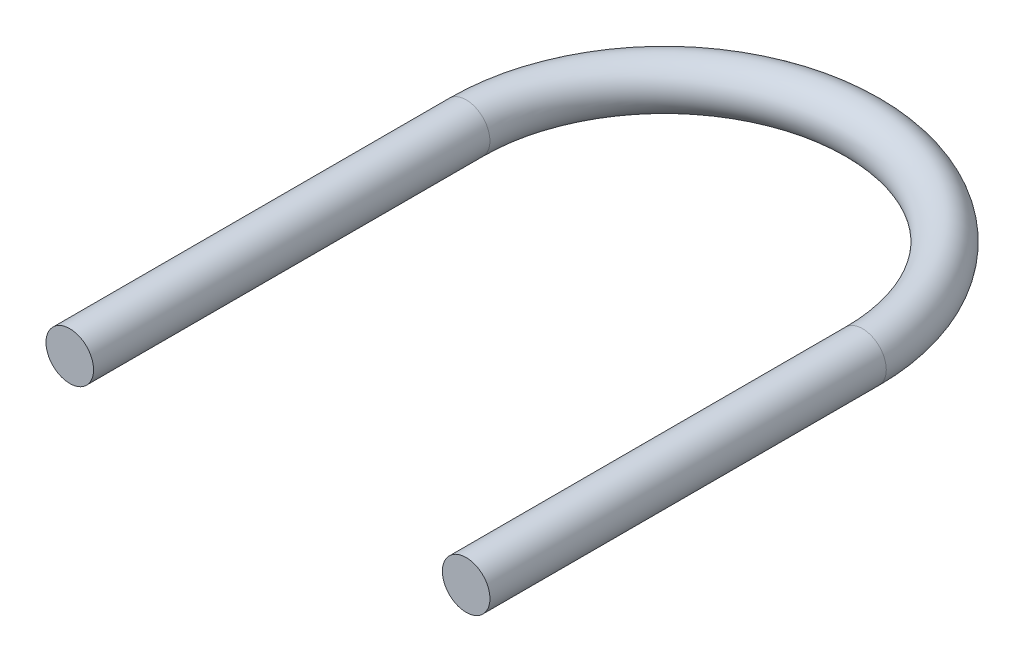
ISO-10303-21;
HEADER;
FILE_DESCRIPTION(('STEP AP214'),'2;1');
FILE_NAME('part.step','',(''),(''),'','','');
FILE_SCHEMA(('AUTOMOTIVE_DESIGN { 1 0 10303 214 1 1 1 1 }'));
ENDSEC;
DATA;
#1=APPLICATION_CONTEXT('core data for automotive mechanical design processes');
#2=APPLICATION_PROTOCOL_DEFINITION('international standard','automotive_design',2000,#1);
#3=PRODUCT_CONTEXT('',#1,'mechanical');
#4=PRODUCT('Part','Part','',(#3));
#5=PRODUCT_RELATED_PRODUCT_CATEGORY('part','',(#4));
#6=PRODUCT_DEFINITION_FORMATION('','',#4);
#7=PRODUCT_DEFINITION_CONTEXT('part definition',#1,'design');
#8=PRODUCT_DEFINITION('design','',#6,#7);
#9=PRODUCT_DEFINITION_SHAPE('','',#8);
#10=(LENGTH_UNIT() NAMED_UNIT(*) SI_UNIT(.MILLI.,.METRE.));
#11=(NAMED_UNIT(*) PLANE_ANGLE_UNIT() SI_UNIT($,.RADIAN.));
#12=(NAMED_UNIT(*) SI_UNIT($,.STERADIAN.) SOLID_ANGLE_UNIT());
#13=UNCERTAINTY_MEASURE_WITH_UNIT(LENGTH_MEASURE(1.E-05),#10,'distance_accuracy_value','');
#14=(GEOMETRIC_REPRESENTATION_CONTEXT(3) GLOBAL_UNCERTAINTY_ASSIGNED_CONTEXT((#13)) GLOBAL_UNIT_ASSIGNED_CONTEXT((#10,
#11,#12)) REPRESENTATION_CONTEXT('',''));
#15=CARTESIAN_POINT('',(0.,0.,0.));
#16=DIRECTION('',(0.,0.,1.));
#17=DIRECTION('',(1.,0.,0.));
#18=AXIS2_PLACEMENT_3D('',#15,#16,#17);
#19=CARTESIAN_POINT('',(-25.,0.,50.0000000000001));
#20=DIRECTION('',(0.,0.,1.));
#21=DIRECTION('',(1.,0.,0.));
#22=AXIS2_PLACEMENT_3D('',#19,#20,#21);
#23=PLANE('',#22);
#24=CARTESIAN_POINT('',(-25.,0.,50.0000000000001));
#25=DIRECTION('',(0.,0.,1.));
#26=DIRECTION('',(1.,0.,0.));
#27=AXIS2_PLACEMENT_3D('',#24,#25,#26);
#28=CIRCLE('',#27,3.);
#29=CARTESIAN_POINT('',(-22.,0.,50.0000000000001));
#30=VERTEX_POINT('',#29);
#31=EDGE_CURVE('E54',#30,#30,#28,.T.);
#32=ORIENTED_EDGE('',*,*,#31,.T.);
#33=EDGE_LOOP('',(#32));
#34=FACE_BOUND('',#33,.T.);
#35=ADVANCED_FACE('F37',(#34),#23,.T.);
#36=CARTESIAN_POINT('',(25.,0.,50.));
#37=DIRECTION('',(0.,0.,-1.));
#38=DIRECTION('',(-1.,0.,0.));
#39=AXIS2_PLACEMENT_3D('',#36,#37,#38);
#40=PLANE('',#39);
#41=CARTESIAN_POINT('',(25.,0.,50.));
#42=DIRECTION('',(0.,0.,-1.));
#43=DIRECTION('',(-1.,0.,0.));
#44=AXIS2_PLACEMENT_3D('',#41,#42,#43);
#45=CIRCLE('',#44,3.);
#46=CARTESIAN_POINT('',(22.,0.,50.));
#47=VERTEX_POINT('',#46);
#48=EDGE_CURVE('E10',#47,#47,#45,.T.);
#49=ORIENTED_EDGE('',*,*,#48,.F.);
#50=EDGE_LOOP('',(#49));
#51=FACE_BOUND('',#50,.T.);
#52=ADVANCED_FACE('F65',(#51),#40,.F.);
#53=CARTESIAN_POINT('',(-25.,0.,50.0000000000001));
#54=DIRECTION('',(0.,0.,-1.));
#55=DIRECTION('',(-1.,0.,0.));
#56=AXIS2_PLACEMENT_3D('',#53,#54,#55);
#57=CYLINDRICAL_SURFACE('',#56,3.);
#58=CARTESIAN_POINT('',(-25.,0.,0.));
#59=DIRECTION('',(0.,0.,1.));
#60=DIRECTION('',(1.,0.,0.));
#61=AXIS2_PLACEMENT_3D('',#58,#59,#60);
#62=CIRCLE('',#61,3.);
#63=CARTESIAN_POINT('',(-28.,0.,0.));
#64=VERTEX_POINT('',#63);
#65=EDGE_CURVE('E49',#64,#64,#62,.T.);
#66=ORIENTED_EDGE('',*,*,#65,.T.);
#67=EDGE_LOOP('',(#66));
#68=FACE_BOUND('',#67,.T.);
#69=ORIENTED_EDGE('',*,*,#31,.F.);
#70=EDGE_LOOP('',(#69));
#71=FACE_BOUND('',#70,.T.);
#72=ADVANCED_FACE('F62',(#68,#71),#57,.T.);
#73=CARTESIAN_POINT('',(0.,0.,0.));
#74=DIRECTION('',(0.,-1.,0.));
#75=DIRECTION('',(0.,0.,-1.));
#76=AXIS2_PLACEMENT_3D('',#73,#74,#75);
#77=TOROIDAL_SURFACE('',#76,25.,3.);
#78=CARTESIAN_POINT('',(25.,0.,0.));
#79=DIRECTION('',(0.,0.,-1.));
#80=DIRECTION('',(-1.,0.,0.));
#81=AXIS2_PLACEMENT_3D('',#78,#79,#80);
#82=CIRCLE('',#81,3.);
#83=CARTESIAN_POINT('',(28.,0.,0.));
#84=VERTEX_POINT('',#83);
#85=EDGE_CURVE('E44',#84,#84,#82,.T.);
#86=CARTESIAN_POINT('',(0.,0.,0.));
#87=DIRECTION('',(0.,-1.,0.));
#88=DIRECTION('',(0.,0.,-1.));
#89=AXIS2_PLACEMENT_3D('',#86,#87,#88);
#90=CIRCLE('',#89,28.);
#91=EDGE_CURVE('',#64,#84,#90,.T.);
#92=ORIENTED_EDGE('',*,*,#65,.F.);
#93=ORIENTED_EDGE('',*,*,#85,.T.);
#94=ORIENTED_EDGE('',*,*,#91,.T.);
#95=ORIENTED_EDGE('',*,*,#91,.F.);
#96=EDGE_LOOP('',(#92,#94,#93,#95));
#97=FACE_BOUND('',#96,.T.);
#98=ADVANCED_FACE('F64',(#97),#77,.T.);
#99=CARTESIAN_POINT('',(25.,0.,0.));
#100=DIRECTION('',(0.,0.,1.));
#101=DIRECTION('',(1.,0.,0.));
#102=AXIS2_PLACEMENT_3D('',#99,#100,#101);
#103=CYLINDRICAL_SURFACE('',#102,3.);
#104=ORIENTED_EDGE('',*,*,#48,.T.);
#105=EDGE_LOOP('',(#104));
#106=FACE_BOUND('',#105,.T.);
#107=ORIENTED_EDGE('',*,*,#85,.F.);
#108=EDGE_LOOP('',(#107));
#109=FACE_BOUND('',#108,.T.);
#110=ADVANCED_FACE('F72',(#106,#109),#103,.T.);
#111=CLOSED_SHELL('',(#35,#52,#72,#98,#110));
#112=MANIFOLD_SOLID_BREP('B2',#111);
#113=ADVANCED_BREP_SHAPE_REPRESENTATION('',(#18,#112),#14);
#114=SHAPE_DEFINITION_REPRESENTATION(#9,#113);
ENDSEC;
END-ISO-10303-21;
